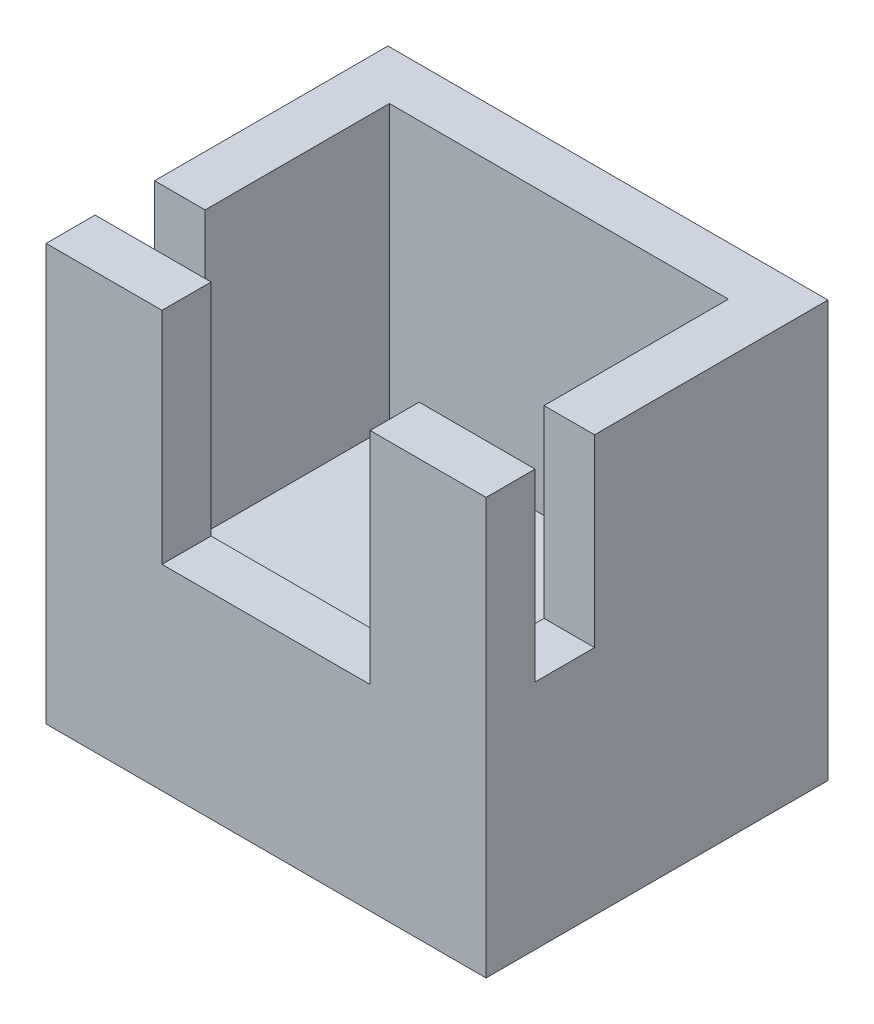
ISO-10303-21;
HEADER;
FILE_DESCRIPTION(('STEP AP214'),'2;1');
FILE_NAME('part.step','',(''),(''),'','','');
FILE_SCHEMA(('AUTOMOTIVE_DESIGN { 1 0 10303 214 1 1 1 1 }'));
ENDSEC;
DATA;
#1=APPLICATION_CONTEXT('core data for automotive mechanical design processes');
#2=APPLICATION_PROTOCOL_DEFINITION('international standard','automotive_design',2000,#1);
#3=PRODUCT_CONTEXT('',#1,'mechanical');
#4=PRODUCT('Part','Part','',(#3));
#5=PRODUCT_RELATED_PRODUCT_CATEGORY('part','',(#4));
#6=PRODUCT_DEFINITION_FORMATION('','',#4);
#7=PRODUCT_DEFINITION_CONTEXT('part definition',#1,'design');
#8=PRODUCT_DEFINITION('design','',#6,#7);
#9=PRODUCT_DEFINITION_SHAPE('','',#8);
#10=(LENGTH_UNIT() NAMED_UNIT(*) SI_UNIT(.MILLI.,.METRE.));
#11=(NAMED_UNIT(*) PLANE_ANGLE_UNIT() SI_UNIT($,.RADIAN.));
#12=(NAMED_UNIT(*) SI_UNIT($,.STERADIAN.) SOLID_ANGLE_UNIT());
#13=UNCERTAINTY_MEASURE_WITH_UNIT(LENGTH_MEASURE(1.E-05),#10,'distance_accuracy_value','');
#14=(GEOMETRIC_REPRESENTATION_CONTEXT(3) GLOBAL_UNCERTAINTY_ASSIGNED_CONTEXT((#13)) GLOBAL_UNIT_ASSIGNED_CONTEXT((#10,
#11,#12)) REPRESENTATION_CONTEXT('',''));
#15=CARTESIAN_POINT('',(0.,0.,0.));
#16=DIRECTION('',(0.,0.,1.));
#17=DIRECTION('',(1.,0.,0.));
#18=AXIS2_PLACEMENT_3D('',#15,#16,#17);
#19=CARTESIAN_POINT('',(3.7,7.,-2.875));
#20=DIRECTION('',(0.,1.,0.));
#21=DIRECTION('',(0.,0.,1.));
#22=AXIS2_PLACEMENT_3D('',#19,#20,#21);
#23=PLANE('',#22);
#24=DIRECTION('',(0.,0.,-1.));
#25=VECTOR('',#24,1.);
#26=CARTESIAN_POINT('',(-1.75,7.,2.875));
#27=LINE('',#26,#25);
#28=CARTESIAN_POINT('',(-1.75,7.,2.875));
#29=VERTEX_POINT('',#28);
#30=CARTESIAN_POINT('',(-1.75,7.,2.05));
#31=VERTEX_POINT('',#30);
#32=EDGE_CURVE('E11',#29,#31,#27,.T.);
#33=ORIENTED_EDGE('',*,*,#32,.T.);
#34=DIRECTION('',(-1.,0.,0.));
#35=VECTOR('',#34,1.);
#36=CARTESIAN_POINT('',(3.7,7.,2.05));
#37=LINE('',#36,#35);
#38=CARTESIAN_POINT('',(-3.7,7.,2.05));
#39=VERTEX_POINT('',#38);
#40=EDGE_CURVE('E23',#31,#39,#37,.T.);
#41=ORIENTED_EDGE('',*,*,#40,.T.);
#42=DIRECTION('',(0.,0.,1.));
#43=VECTOR('',#42,1.);
#44=CARTESIAN_POINT('',(-3.7,7.,-2.875));
#45=LINE('',#44,#43);
#46=CARTESIAN_POINT('',(-3.7,7.,2.875));
#47=VERTEX_POINT('',#46);
#48=EDGE_CURVE('E290',#39,#47,#45,.T.);
#49=ORIENTED_EDGE('',*,*,#48,.T.);
#50=DIRECTION('',(-1.,0.,0.));
#51=VECTOR('',#50,1.);
#52=CARTESIAN_POINT('',(3.7,7.,2.875));
#53=LINE('',#52,#51);
#54=EDGE_CURVE('E287',#29,#47,#53,.T.);
#55=ORIENTED_EDGE('',*,*,#54,.F.);
#56=EDGE_LOOP('',(#33,#41,#49,#55));
#57=FACE_BOUND('',#56,.T.);
#58=ADVANCED_FACE('F16',(#57),#23,.T.);
#59=CARTESIAN_POINT('',(3.7,7.,1.05));
#60=DIRECTION('',(0.,0.,-1.));
#61=DIRECTION('',(-1.,0.,0.));
#62=AXIS2_PLACEMENT_3D('',#59,#60,#61);
#63=PLANE('',#62);
#64=DIRECTION('',(-1.,0.,0.));
#65=VECTOR('',#64,1.);
#66=CARTESIAN_POINT('',(3.7,7.,1.05));
#67=LINE('',#66,#65);
#68=CARTESIAN_POINT('',(3.7,7.,1.05));
#69=VERTEX_POINT('',#68);
#70=CARTESIAN_POINT('',(2.85,7.,1.05));
#71=VERTEX_POINT('',#70);
#72=EDGE_CURVE('E285',#69,#71,#67,.T.);
#73=ORIENTED_EDGE('',*,*,#72,.T.);
#74=DIRECTION('',(0.,1.,0.));
#75=VECTOR('',#74,1.);
#76=CARTESIAN_POINT('',(2.85,2.3,1.05));
#77=LINE('',#76,#75);
#78=CARTESIAN_POINT('',(2.85,3.9,1.05));
#79=VERTEX_POINT('',#78);
#80=EDGE_CURVE('E282',#79,#71,#77,.T.);
#81=ORIENTED_EDGE('',*,*,#80,.F.);
#82=DIRECTION('',(-1.,0.,0.));
#83=VECTOR('',#82,1.);
#84=CARTESIAN_POINT('',(3.7,3.9,1.05));
#85=LINE('',#84,#83);
#86=CARTESIAN_POINT('',(3.7,3.9,1.05));
#87=VERTEX_POINT('',#86);
#88=EDGE_CURVE('E279',#87,#79,#85,.T.);
#89=ORIENTED_EDGE('',*,*,#88,.F.);
#90=DIRECTION('',(0.,-1.,0.));
#91=VECTOR('',#90,1.);
#92=CARTESIAN_POINT('',(3.7,7.,1.05));
#93=LINE('',#92,#91);
#94=EDGE_CURVE('E276',#69,#87,#93,.T.);
#95=ORIENTED_EDGE('',*,*,#94,.F.);
#96=EDGE_LOOP('',(#73,#81,#89,#95));
#97=FACE_BOUND('',#96,.T.);
#98=ADVANCED_FACE('F342',(#97),#63,.F.);
#99=CARTESIAN_POINT('',(3.7,3.9,1.05));
#100=DIRECTION('',(0.,-1.,0.));
#101=DIRECTION('',(0.,0.,-1.));
#102=AXIS2_PLACEMENT_3D('',#99,#100,#101);
#103=PLANE('',#102);
#104=ORIENTED_EDGE('',*,*,#88,.T.);
#105=DIRECTION('',(0.,0.,-1.));
#106=VECTOR('',#105,1.);
#107=CARTESIAN_POINT('',(2.85,3.9,2.05));
#108=LINE('',#107,#106);
#109=CARTESIAN_POINT('',(2.85,3.9,2.05));
#110=VERTEX_POINT('',#109);
#111=EDGE_CURVE('E273',#110,#79,#108,.T.);
#112=ORIENTED_EDGE('',*,*,#111,.F.);
#113=DIRECTION('',(-1.,0.,0.));
#114=VECTOR('',#113,1.);
#115=CARTESIAN_POINT('',(3.7,3.9,2.05));
#116=LINE('',#115,#114);
#117=CARTESIAN_POINT('',(3.7,3.9,2.05));
#118=VERTEX_POINT('',#117);
#119=EDGE_CURVE('E270',#118,#110,#116,.T.);
#120=ORIENTED_EDGE('',*,*,#119,.F.);
#121=DIRECTION('',(0.,0.,1.));
#122=VECTOR('',#121,1.);
#123=CARTESIAN_POINT('',(3.7,3.9,1.05));
#124=LINE('',#123,#122);
#125=EDGE_CURVE('E267',#87,#118,#124,.T.);
#126=ORIENTED_EDGE('',*,*,#125,.F.);
#127=EDGE_LOOP('',(#104,#112,#120,#126));
#128=FACE_BOUND('',#127,.T.);
#129=ADVANCED_FACE('F338',(#128),#103,.F.);
#130=CARTESIAN_POINT('',(3.7,7.,-2.875));
#131=DIRECTION('',(0.,1.,0.));
#132=DIRECTION('',(0.,0.,1.));
#133=AXIS2_PLACEMENT_3D('',#130,#131,#132);
#134=PLANE('',#133);
#135=DIRECTION('',(0.,0.,-1.));
#136=VECTOR('',#135,1.);
#137=CARTESIAN_POINT('',(1.75,7.,2.875));
#138=LINE('',#137,#136);
#139=CARTESIAN_POINT('',(1.75,7.,2.875));
#140=VERTEX_POINT('',#139);
#141=CARTESIAN_POINT('',(1.75,7.,2.05));
#142=VERTEX_POINT('',#141);
#143=EDGE_CURVE('E265',#140,#142,#138,.T.);
#144=ORIENTED_EDGE('',*,*,#143,.F.);
#145=DIRECTION('',(-1.,0.,0.));
#146=VECTOR('',#145,1.);
#147=CARTESIAN_POINT('',(3.7,7.,2.875));
#148=LINE('',#147,#146);
#149=CARTESIAN_POINT('',(3.7,7.,2.875));
#150=VERTEX_POINT('',#149);
#151=EDGE_CURVE('E262',#150,#140,#148,.T.);
#152=ORIENTED_EDGE('',*,*,#151,.F.);
#153=DIRECTION('',(0.,0.,1.));
#154=VECTOR('',#153,1.);
#155=CARTESIAN_POINT('',(3.7,7.,-2.875));
#156=LINE('',#155,#154);
#157=CARTESIAN_POINT('',(3.7,7.,2.05));
#158=VERTEX_POINT('',#157);
#159=EDGE_CURVE('E259',#158,#150,#156,.T.);
#160=ORIENTED_EDGE('',*,*,#159,.F.);
#161=DIRECTION('',(-1.,0.,0.));
#162=VECTOR('',#161,1.);
#163=CARTESIAN_POINT('',(3.7,7.,2.05));
#164=LINE('',#163,#162);
#165=EDGE_CURVE('E256',#158,#142,#164,.T.);
#166=ORIENTED_EDGE('',*,*,#165,.T.);
#167=EDGE_LOOP('',(#144,#152,#160,#166));
#168=FACE_BOUND('',#167,.T.);
#169=ADVANCED_FACE('F333',(#168),#134,.T.);
#170=CARTESIAN_POINT('',(-3.7,0.,-2.875));
#171=DIRECTION('',(0.,-1.,0.));
#172=DIRECTION('',(0.,0.,-1.));
#173=AXIS2_PLACEMENT_3D('',#170,#171,#172);
#174=PLANE('',#173);
#175=DIRECTION('',(1.,0.,0.));
#176=VECTOR('',#175,1.);
#177=CARTESIAN_POINT('',(-3.7,0.,2.875));
#178=LINE('',#177,#176);
#179=CARTESIAN_POINT('',(-3.7,0.,2.875));
#180=VERTEX_POINT('',#179);
#181=CARTESIAN_POINT('',(3.7,0.,2.875));
#182=VERTEX_POINT('',#181);
#183=EDGE_CURVE('E254',#180,#182,#178,.T.);
#184=ORIENTED_EDGE('',*,*,#183,.F.);
#185=DIRECTION('',(0.,0.,1.));
#186=VECTOR('',#185,1.);
#187=CARTESIAN_POINT('',(-3.7,0.,-2.875));
#188=LINE('',#187,#186);
#189=CARTESIAN_POINT('',(-3.7,0.,-2.875));
#190=VERTEX_POINT('',#189);
#191=EDGE_CURVE('E251',#190,#180,#188,.T.);
#192=ORIENTED_EDGE('',*,*,#191,.F.);
#193=DIRECTION('',(1.,0.,0.));
#194=VECTOR('',#193,1.);
#195=CARTESIAN_POINT('',(-3.7,0.,-2.875));
#196=LINE('',#195,#194);
#197=CARTESIAN_POINT('',(3.7,0.,-2.875));
#198=VERTEX_POINT('',#197);
#199=EDGE_CURVE('E249',#190,#198,#196,.T.);
#200=ORIENTED_EDGE('',*,*,#199,.T.);
#201=DIRECTION('',(0.,0.,1.));
#202=VECTOR('',#201,1.);
#203=CARTESIAN_POINT('',(3.7,0.,-2.875));
#204=LINE('',#203,#202);
#205=EDGE_CURVE('E246',#198,#182,#204,.T.);
#206=ORIENTED_EDGE('',*,*,#205,.T.);
#207=EDGE_LOOP('',(#184,#192,#200,#206));
#208=FACE_BOUND('',#207,.T.);
#209=ADVANCED_FACE('F317',(#208),#174,.T.);
#210=CARTESIAN_POINT('',(-3.7,7.,-2.875));
#211=DIRECTION('',(-1.,0.,0.));
#212=DIRECTION('',(0.,0.,1.));
#213=AXIS2_PLACEMENT_3D('',#210,#211,#212);
#214=PLANE('',#213);
#215=DIRECTION('',(0.,1.,0.));
#216=VECTOR('',#215,1.);
#217=CARTESIAN_POINT('',(-3.7,3.9,2.05));
#218=LINE('',#217,#216);
#219=CARTESIAN_POINT('',(-3.7,3.9,2.05));
#220=VERTEX_POINT('',#219);
#221=EDGE_CURVE('E243',#220,#39,#218,.T.);
#222=ORIENTED_EDGE('',*,*,#221,.F.);
#223=DIRECTION('',(0.,0.,1.));
#224=VECTOR('',#223,1.);
#225=CARTESIAN_POINT('',(-3.7,3.9,1.05));
#226=LINE('',#225,#224);
#227=CARTESIAN_POINT('',(-3.7,3.9,1.05));
#228=VERTEX_POINT('',#227);
#229=EDGE_CURVE('E240',#228,#220,#226,.T.);
#230=ORIENTED_EDGE('',*,*,#229,.F.);
#231=DIRECTION('',(0.,-1.,0.));
#232=VECTOR('',#231,1.);
#233=CARTESIAN_POINT('',(-3.7,7.,1.05));
#234=LINE('',#233,#232);
#235=CARTESIAN_POINT('',(-3.7,7.,1.05));
#236=VERTEX_POINT('',#235);
#237=EDGE_CURVE('E237',#236,#228,#234,.T.);
#238=ORIENTED_EDGE('',*,*,#237,.F.);
#239=DIRECTION('',(0.,0.,1.));
#240=VECTOR('',#239,1.);
#241=CARTESIAN_POINT('',(-3.7,7.,-2.875));
#242=LINE('',#241,#240);
#243=CARTESIAN_POINT('',(-3.7,7.,-2.875));
#244=VERTEX_POINT('',#243);
#245=EDGE_CURVE('E234',#244,#236,#242,.T.);
#246=ORIENTED_EDGE('',*,*,#245,.F.);
#247=DIRECTION('',(0.,-1.,0.));
#248=VECTOR('',#247,1.);
#249=CARTESIAN_POINT('',(-3.7,7.,-2.875));
#250=LINE('',#249,#248);
#251=EDGE_CURVE('E231',#244,#190,#250,.T.);
#252=ORIENTED_EDGE('',*,*,#251,.T.);
#253=ORIENTED_EDGE('',*,*,#191,.T.);
#254=DIRECTION('',(0.,-1.,0.));
#255=VECTOR('',#254,1.);
#256=CARTESIAN_POINT('',(-3.7,7.,2.875));
#257=LINE('',#256,#255);
#258=EDGE_CURVE('E228',#47,#180,#257,.T.);
#259=ORIENTED_EDGE('',*,*,#258,.F.);
#260=ORIENTED_EDGE('',*,*,#48,.F.);
#261=EDGE_LOOP('',(#222,#230,#238,#246,#252,#253,#259,#260));
#262=FACE_BOUND('',#261,.T.);
#263=ADVANCED_FACE('F295',(#262),#214,.T.);
#264=CARTESIAN_POINT('',(3.7,7.,-2.875));
#265=DIRECTION('',(0.,1.,0.));
#266=DIRECTION('',(0.,0.,1.));
#267=AXIS2_PLACEMENT_3D('',#264,#265,#266);
#268=PLANE('',#267);
#269=DIRECTION('',(0.,0.,1.));
#270=VECTOR('',#269,1.);
#271=CARTESIAN_POINT('',(2.85,7.,-2.05));
#272=LINE('',#271,#270);
#273=CARTESIAN_POINT('',(2.85,7.,-2.05));
#274=VERTEX_POINT('',#273);
#275=EDGE_CURVE('E225',#274,#71,#272,.T.);
#276=ORIENTED_EDGE('',*,*,#275,.T.);
#277=ORIENTED_EDGE('',*,*,#72,.F.);
#278=DIRECTION('',(0.,0.,1.));
#279=VECTOR('',#278,1.);
#280=CARTESIAN_POINT('',(3.7,7.,-2.875));
#281=LINE('',#280,#279);
#282=CARTESIAN_POINT('',(3.7,7.,-2.875));
#283=VERTEX_POINT('',#282);
#284=EDGE_CURVE('E222',#283,#69,#281,.T.);
#285=ORIENTED_EDGE('',*,*,#284,.F.);
#286=DIRECTION('',(-1.,0.,0.));
#287=VECTOR('',#286,1.);
#288=CARTESIAN_POINT('',(3.7,7.,-2.875));
#289=LINE('',#288,#287);
#290=EDGE_CURVE('E219',#283,#244,#289,.T.);
#291=ORIENTED_EDGE('',*,*,#290,.T.);
#292=ORIENTED_EDGE('',*,*,#245,.T.);
#293=DIRECTION('',(-1.,0.,0.));
#294=VECTOR('',#293,1.);
#295=CARTESIAN_POINT('',(3.7,7.,1.05));
#296=LINE('',#295,#294);
#297=CARTESIAN_POINT('',(-2.85,7.,1.05));
#298=VERTEX_POINT('',#297);
#299=EDGE_CURVE('E216',#298,#236,#296,.T.);
#300=ORIENTED_EDGE('',*,*,#299,.F.);
#301=DIRECTION('',(0.,0.,1.));
#302=VECTOR('',#301,1.);
#303=CARTESIAN_POINT('',(-2.85,7.,-2.05));
#304=LINE('',#303,#302);
#305=CARTESIAN_POINT('',(-2.85,7.,-2.05));
#306=VERTEX_POINT('',#305);
#307=EDGE_CURVE('E214',#306,#298,#304,.T.);
#308=ORIENTED_EDGE('',*,*,#307,.F.);
#309=DIRECTION('',(-1.,0.,0.));
#310=VECTOR('',#309,1.);
#311=CARTESIAN_POINT('',(2.85,7.,-2.05));
#312=LINE('',#311,#310);
#313=EDGE_CURVE('E156',#274,#306,#312,.T.);
#314=ORIENTED_EDGE('',*,*,#313,.F.);
#315=EDGE_LOOP('',(#276,#277,#285,#291,#292,#300,#308,#314));
#316=FACE_BOUND('',#315,.T.);
#317=ADVANCED_FACE('F306',(#316),#268,.T.);
#318=CARTESIAN_POINT('',(3.7,0.,-2.875));
#319=DIRECTION('',(1.,0.,0.));
#320=DIRECTION('',(0.,0.,-1.));
#321=AXIS2_PLACEMENT_3D('',#318,#319,#320);
#322=PLANE('',#321);
#323=DIRECTION('',(0.,1.,0.));
#324=VECTOR('',#323,1.);
#325=CARTESIAN_POINT('',(3.7,3.9,2.05));
#326=LINE('',#325,#324);
#327=EDGE_CURVE('E210',#118,#158,#326,.T.);
#328=ORIENTED_EDGE('',*,*,#327,.T.);
#329=ORIENTED_EDGE('',*,*,#159,.T.);
#330=DIRECTION('',(0.,1.,0.));
#331=VECTOR('',#330,1.);
#332=CARTESIAN_POINT('',(3.7,0.,2.875));
#333=LINE('',#332,#331);
#334=EDGE_CURVE('E207',#182,#150,#333,.T.);
#335=ORIENTED_EDGE('',*,*,#334,.F.);
#336=ORIENTED_EDGE('',*,*,#205,.F.);
#337=DIRECTION('',(0.,1.,0.));
#338=VECTOR('',#337,1.);
#339=CARTESIAN_POINT('',(3.7,0.,-2.875));
#340=LINE('',#339,#338);
#341=EDGE_CURVE('E204',#198,#283,#340,.T.);
#342=ORIENTED_EDGE('',*,*,#341,.T.);
#343=ORIENTED_EDGE('',*,*,#284,.T.);
#344=ORIENTED_EDGE('',*,*,#94,.T.);
#345=ORIENTED_EDGE('',*,*,#125,.T.);
#346=EDGE_LOOP('',(#328,#329,#335,#336,#342,#343,#344,#345));
#347=FACE_BOUND('',#346,.T.);
#348=ADVANCED_FACE('F314',(#347),#322,.T.);
#349=CARTESIAN_POINT('',(0.,0.,-2.875));
#350=DIRECTION('',(0.,0.,1.));
#351=DIRECTION('',(1.,0.,0.));
#352=AXIS2_PLACEMENT_3D('',#349,#350,#351);
#353=PLANE('',#352);
#354=ORIENTED_EDGE('',*,*,#199,.F.);
#355=ORIENTED_EDGE('',*,*,#251,.F.);
#356=ORIENTED_EDGE('',*,*,#290,.F.);
#357=ORIENTED_EDGE('',*,*,#341,.F.);
#358=EDGE_LOOP('',(#354,#355,#356,#357));
#359=FACE_BOUND('',#358,.T.);
#360=ADVANCED_FACE('F311',(#359),#353,.F.);
#361=CARTESIAN_POINT('',(0.,0.,2.875));
#362=DIRECTION('',(0.,0.,1.));
#363=DIRECTION('',(1.,0.,0.));
#364=AXIS2_PLACEMENT_3D('',#361,#362,#363);
#365=PLANE('',#364);
#366=DIRECTION('',(0.,1.,0.));
#367=VECTOR('',#366,1.);
#368=CARTESIAN_POINT('',(-1.75,3.3,2.875));
#369=LINE('',#368,#367);
#370=CARTESIAN_POINT('',(-1.75,3.3,2.875));
#371=VERTEX_POINT('',#370);
#372=EDGE_CURVE('E201',#371,#29,#369,.T.);
#373=ORIENTED_EDGE('',*,*,#372,.T.);
#374=ORIENTED_EDGE('',*,*,#54,.T.);
#375=ORIENTED_EDGE('',*,*,#258,.T.);
#376=ORIENTED_EDGE('',*,*,#183,.T.);
#377=ORIENTED_EDGE('',*,*,#334,.T.);
#378=ORIENTED_EDGE('',*,*,#151,.T.);
#379=DIRECTION('',(0.,-1.,0.));
#380=VECTOR('',#379,1.);
#381=CARTESIAN_POINT('',(1.75,7.,2.875));
#382=LINE('',#381,#380);
#383=CARTESIAN_POINT('',(1.75,3.3,2.875));
#384=VERTEX_POINT('',#383);
#385=EDGE_CURVE('E199',#140,#384,#382,.T.);
#386=ORIENTED_EDGE('',*,*,#385,.T.);
#387=DIRECTION('',(-1.,0.,0.));
#388=VECTOR('',#387,1.);
#389=CARTESIAN_POINT('',(1.75,3.3,2.875));
#390=LINE('',#389,#388);
#391=EDGE_CURVE('E196',#384,#371,#390,.T.);
#392=ORIENTED_EDGE('',*,*,#391,.T.);
#393=EDGE_LOOP('',(#373,#374,#375,#376,#377,#378,#386,#392));
#394=FACE_BOUND('',#393,.T.);
#395=ADVANCED_FACE('F319',(#394),#365,.T.);
#396=CARTESIAN_POINT('',(3.7,3.9,2.05));
#397=DIRECTION('',(0.,0.,1.));
#398=DIRECTION('',(0.,-1.,0.));
#399=AXIS2_PLACEMENT_3D('',#396,#397,#398);
#400=PLANE('',#399);
#401=ORIENTED_EDGE('',*,*,#40,.F.);
#402=DIRECTION('',(0.,1.,0.));
#403=VECTOR('',#402,1.);
#404=CARTESIAN_POINT('',(-1.75,3.3,2.05));
#405=LINE('',#404,#403);
#406=CARTESIAN_POINT('',(-1.75,3.3,2.05));
#407=VERTEX_POINT('',#406);
#408=EDGE_CURVE('E194',#407,#31,#405,.T.);
#409=ORIENTED_EDGE('',*,*,#408,.F.);
#410=DIRECTION('',(-1.,0.,0.));
#411=VECTOR('',#410,1.);
#412=CARTESIAN_POINT('',(1.75,3.3,2.05));
#413=LINE('',#412,#411);
#414=CARTESIAN_POINT('',(1.75,3.3,2.05));
#415=VERTEX_POINT('',#414);
#416=EDGE_CURVE('E191',#415,#407,#413,.T.);
#417=ORIENTED_EDGE('',*,*,#416,.F.);
#418=DIRECTION('',(0.,-1.,0.));
#419=VECTOR('',#418,1.);
#420=CARTESIAN_POINT('',(1.75,7.,2.05));
#421=LINE('',#420,#419);
#422=EDGE_CURVE('E188',#142,#415,#421,.T.);
#423=ORIENTED_EDGE('',*,*,#422,.F.);
#424=ORIENTED_EDGE('',*,*,#165,.F.);
#425=ORIENTED_EDGE('',*,*,#327,.F.);
#426=ORIENTED_EDGE('',*,*,#119,.T.);
#427=DIRECTION('',(0.,1.,0.));
#428=VECTOR('',#427,1.);
#429=CARTESIAN_POINT('',(2.85,2.3,2.05));
#430=LINE('',#429,#428);
#431=CARTESIAN_POINT('',(2.85,2.3,2.05));
#432=VERTEX_POINT('',#431);
#433=EDGE_CURVE('E185',#432,#110,#430,.T.);
#434=ORIENTED_EDGE('',*,*,#433,.F.);
#435=DIRECTION('',(1.,0.,0.));
#436=VECTOR('',#435,1.);
#437=CARTESIAN_POINT('',(-2.85,2.3,2.05));
#438=LINE('',#437,#436);
#439=CARTESIAN_POINT('',(-2.85,2.3,2.05));
#440=VERTEX_POINT('',#439);
#441=EDGE_CURVE('E183',#440,#432,#438,.T.);
#442=ORIENTED_EDGE('',*,*,#441,.F.);
#443=DIRECTION('',(0.,1.,0.));
#444=VECTOR('',#443,1.);
#445=CARTESIAN_POINT('',(-2.85,2.3,2.05));
#446=LINE('',#445,#444);
#447=CARTESIAN_POINT('',(-2.85,3.9,2.05));
#448=VERTEX_POINT('',#447);
#449=EDGE_CURVE('E143',#440,#448,#446,.T.);
#450=ORIENTED_EDGE('',*,*,#449,.T.);
#451=DIRECTION('',(-1.,0.,0.));
#452=VECTOR('',#451,1.);
#453=CARTESIAN_POINT('',(3.7,3.9,2.05));
#454=LINE('',#453,#452);
#455=EDGE_CURVE('E179',#448,#220,#454,.T.);
#456=ORIENTED_EDGE('',*,*,#455,.T.);
#457=ORIENTED_EDGE('',*,*,#221,.T.);
#458=EDGE_LOOP('',(#401,#409,#417,#423,#424,#425,#426,#434,#442,#450,#456,#457));
#459=FACE_BOUND('',#458,.T.);
#460=ADVANCED_FACE('F296',(#459),#400,.F.);
#461=CARTESIAN_POINT('',(3.7,3.9,1.05));
#462=DIRECTION('',(0.,-1.,0.));
#463=DIRECTION('',(0.,0.,-1.));
#464=AXIS2_PLACEMENT_3D('',#461,#462,#463);
#465=PLANE('',#464);
#466=ORIENTED_EDGE('',*,*,#455,.F.);
#467=DIRECTION('',(0.,0.,1.));
#468=VECTOR('',#467,1.);
#469=CARTESIAN_POINT('',(-2.85,3.9,1.05));
#470=LINE('',#469,#468);
#471=CARTESIAN_POINT('',(-2.85,3.9,1.05));
#472=VERTEX_POINT('',#471);
#473=EDGE_CURVE('E177',#472,#448,#470,.T.);
#474=ORIENTED_EDGE('',*,*,#473,.F.);
#475=DIRECTION('',(-1.,0.,0.));
#476=VECTOR('',#475,1.);
#477=CARTESIAN_POINT('',(3.7,3.9,1.05));
#478=LINE('',#477,#476);
#479=EDGE_CURVE('E174',#472,#228,#478,.T.);
#480=ORIENTED_EDGE('',*,*,#479,.T.);
#481=ORIENTED_EDGE('',*,*,#229,.T.);
#482=EDGE_LOOP('',(#466,#474,#480,#481));
#483=FACE_BOUND('',#482,.T.);
#484=ADVANCED_FACE('F299',(#483),#465,.F.);
#485=CARTESIAN_POINT('',(3.7,7.,1.05));
#486=DIRECTION('',(0.,0.,-1.));
#487=DIRECTION('',(-1.,0.,0.));
#488=AXIS2_PLACEMENT_3D('',#485,#486,#487);
#489=PLANE('',#488);
#490=ORIENTED_EDGE('',*,*,#479,.F.);
#491=DIRECTION('',(0.,-1.,0.));
#492=VECTOR('',#491,1.);
#493=CARTESIAN_POINT('',(-2.85,7.,1.05));
#494=LINE('',#493,#492);
#495=EDGE_CURVE('E171',#298,#472,#494,.T.);
#496=ORIENTED_EDGE('',*,*,#495,.F.);
#497=ORIENTED_EDGE('',*,*,#299,.T.);
#498=ORIENTED_EDGE('',*,*,#237,.T.);
#499=EDGE_LOOP('',(#490,#496,#497,#498));
#500=FACE_BOUND('',#499,.T.);
#501=ADVANCED_FACE('F303',(#500),#489,.F.);
#502=CARTESIAN_POINT('',(2.85,2.3,2.05));
#503=DIRECTION('',(1.,0.,0.));
#504=DIRECTION('',(0.,0.,-1.));
#505=AXIS2_PLACEMENT_3D('',#502,#503,#504);
#506=PLANE('',#505);
#507=ORIENTED_EDGE('',*,*,#111,.T.);
#508=ORIENTED_EDGE('',*,*,#80,.T.);
#509=ORIENTED_EDGE('',*,*,#275,.F.);
#510=DIRECTION('',(0.,1.,0.));
#511=VECTOR('',#510,1.);
#512=CARTESIAN_POINT('',(2.85,2.3,-2.05));
#513=LINE('',#512,#511);
#514=CARTESIAN_POINT('',(2.85,2.3,-2.05));
#515=VERTEX_POINT('',#514);
#516=EDGE_CURVE('E169',#515,#274,#513,.T.);
#517=ORIENTED_EDGE('',*,*,#516,.F.);
#518=DIRECTION('',(0.,0.,-1.));
#519=VECTOR('',#518,1.);
#520=CARTESIAN_POINT('',(2.85,2.3,2.05));
#521=LINE('',#520,#519);
#522=EDGE_CURVE('E147',#432,#515,#521,.T.);
#523=ORIENTED_EDGE('',*,*,#522,.F.);
#524=ORIENTED_EDGE('',*,*,#433,.T.);
#525=EDGE_LOOP('',(#507,#508,#509,#517,#523,#524));
#526=FACE_BOUND('',#525,.T.);
#527=ADVANCED_FACE('F340',(#526),#506,.F.);
#528=CARTESIAN_POINT('',(-2.85,2.3,1.05));
#529=DIRECTION('',(-1.,0.,0.));
#530=DIRECTION('',(0.,0.,1.));
#531=AXIS2_PLACEMENT_3D('',#528,#529,#530);
#532=PLANE('',#531);
#533=ORIENTED_EDGE('',*,*,#473,.T.);
#534=ORIENTED_EDGE('',*,*,#449,.F.);
#535=DIRECTION('',(0.,0.,1.));
#536=VECTOR('',#535,1.);
#537=CARTESIAN_POINT('',(-2.85,2.3,1.05));
#538=LINE('',#537,#536);
#539=CARTESIAN_POINT('',(-2.85,2.3,-2.05));
#540=VERTEX_POINT('',#539);
#541=EDGE_CURVE('E137',#540,#440,#538,.T.);
#542=ORIENTED_EDGE('',*,*,#541,.F.);
#543=DIRECTION('',(0.,-1.,0.));
#544=VECTOR('',#543,1.);
#545=CARTESIAN_POINT('',(-2.85,7.,-2.05));
#546=LINE('',#545,#544);
#547=EDGE_CURVE('E142',#306,#540,#546,.T.);
#548=ORIENTED_EDGE('',*,*,#547,.F.);
#549=ORIENTED_EDGE('',*,*,#307,.T.);
#550=ORIENTED_EDGE('',*,*,#495,.T.);
#551=EDGE_LOOP('',(#533,#534,#542,#548,#549,#550));
#552=FACE_BOUND('',#551,.T.);
#553=ADVANCED_FACE('F140',(#552),#532,.F.);
#554=CARTESIAN_POINT('',(0.,2.3,0.));
#555=DIRECTION('',(0.,1.,0.));
#556=DIRECTION('',(0.,0.,1.));
#557=AXIS2_PLACEMENT_3D('',#554,#555,#556);
#558=PLANE('',#557);
#559=ORIENTED_EDGE('',*,*,#522,.T.);
#560=DIRECTION('',(1.,0.,0.));
#561=VECTOR('',#560,1.);
#562=CARTESIAN_POINT('',(-2.85,2.3,-2.05));
#563=LINE('',#562,#561);
#564=EDGE_CURVE('E154',#540,#515,#563,.T.);
#565=ORIENTED_EDGE('',*,*,#564,.F.);
#566=ORIENTED_EDGE('',*,*,#541,.T.);
#567=ORIENTED_EDGE('',*,*,#441,.T.);
#568=EDGE_LOOP('',(#559,#565,#566,#567));
#569=FACE_BOUND('',#568,.T.);
#570=ADVANCED_FACE('F159',(#569),#558,.T.);
#571=CARTESIAN_POINT('',(0.,0.,-2.05));
#572=DIRECTION('',(0.,0.,1.));
#573=DIRECTION('',(1.,0.,0.));
#574=AXIS2_PLACEMENT_3D('',#571,#572,#573);
#575=PLANE('',#574);
#576=ORIENTED_EDGE('',*,*,#313,.T.);
#577=ORIENTED_EDGE('',*,*,#547,.T.);
#578=ORIENTED_EDGE('',*,*,#564,.T.);
#579=ORIENTED_EDGE('',*,*,#516,.T.);
#580=EDGE_LOOP('',(#576,#577,#578,#579));
#581=FACE_BOUND('',#580,.T.);
#582=ADVANCED_FACE('F152',(#581),#575,.T.);
#583=CARTESIAN_POINT('',(-1.75,3.3,2.875));
#584=DIRECTION('',(-1.,0.,0.));
#585=DIRECTION('',(0.,0.,1.));
#586=AXIS2_PLACEMENT_3D('',#583,#584,#585);
#587=PLANE('',#586);
#588=ORIENTED_EDGE('',*,*,#408,.T.);
#589=ORIENTED_EDGE('',*,*,#32,.F.);
#590=ORIENTED_EDGE('',*,*,#372,.F.);
#591=DIRECTION('',(0.,0.,-1.));
#592=VECTOR('',#591,1.);
#593=CARTESIAN_POINT('',(-1.75,3.3,2.875));
#594=LINE('',#593,#592);
#595=EDGE_CURVE('E161',#371,#407,#594,.T.);
#596=ORIENTED_EDGE('',*,*,#595,.T.);
#597=EDGE_LOOP('',(#588,#589,#590,#596));
#598=FACE_BOUND('',#597,.T.);
#599=ADVANCED_FACE('F322',(#598),#587,.F.);
#600=CARTESIAN_POINT('',(1.75,3.3,2.875));
#601=DIRECTION('',(0.,-1.,0.));
#602=DIRECTION('',(0.,0.,-1.));
#603=AXIS2_PLACEMENT_3D('',#600,#601,#602);
#604=PLANE('',#603);
#605=ORIENTED_EDGE('',*,*,#416,.T.);
#606=ORIENTED_EDGE('',*,*,#595,.F.);
#607=ORIENTED_EDGE('',*,*,#391,.F.);
#608=DIRECTION('',(0.,0.,-1.));
#609=VECTOR('',#608,1.);
#610=CARTESIAN_POINT('',(1.75,3.3,2.875));
#611=LINE('',#610,#609);
#612=EDGE_CURVE('E164',#384,#415,#611,.T.);
#613=ORIENTED_EDGE('',*,*,#612,.T.);
#614=EDGE_LOOP('',(#605,#606,#607,#613));
#615=FACE_BOUND('',#614,.T.);
#616=ADVANCED_FACE('F324',(#615),#604,.F.);
#617=CARTESIAN_POINT('',(1.75,7.,2.875));
#618=DIRECTION('',(1.,0.,0.));
#619=DIRECTION('',(0.,0.,-1.));
#620=AXIS2_PLACEMENT_3D('',#617,#618,#619);
#621=PLANE('',#620);
#622=ORIENTED_EDGE('',*,*,#422,.T.);
#623=ORIENTED_EDGE('',*,*,#612,.F.);
#624=ORIENTED_EDGE('',*,*,#385,.F.);
#625=ORIENTED_EDGE('',*,*,#143,.T.);
#626=EDGE_LOOP('',(#622,#623,#624,#625));
#627=FACE_BOUND('',#626,.T.);
#628=ADVANCED_FACE('F330',(#627),#621,.F.);
#629=CLOSED_SHELL('',(#58,#98,#129,#169,#209,#263,#317,#348,#360,#395,#460,#484,#501,#527,#553,
#570,#582,#599,#616,#628));
#630=MANIFOLD_SOLID_BREP('B1',#629);
#631=ADVANCED_BREP_SHAPE_REPRESENTATION('',(#18,#630),#14);
#632=SHAPE_DEFINITION_REPRESENTATION(#9,#631);
ENDSEC;
END-ISO-10303-21;
